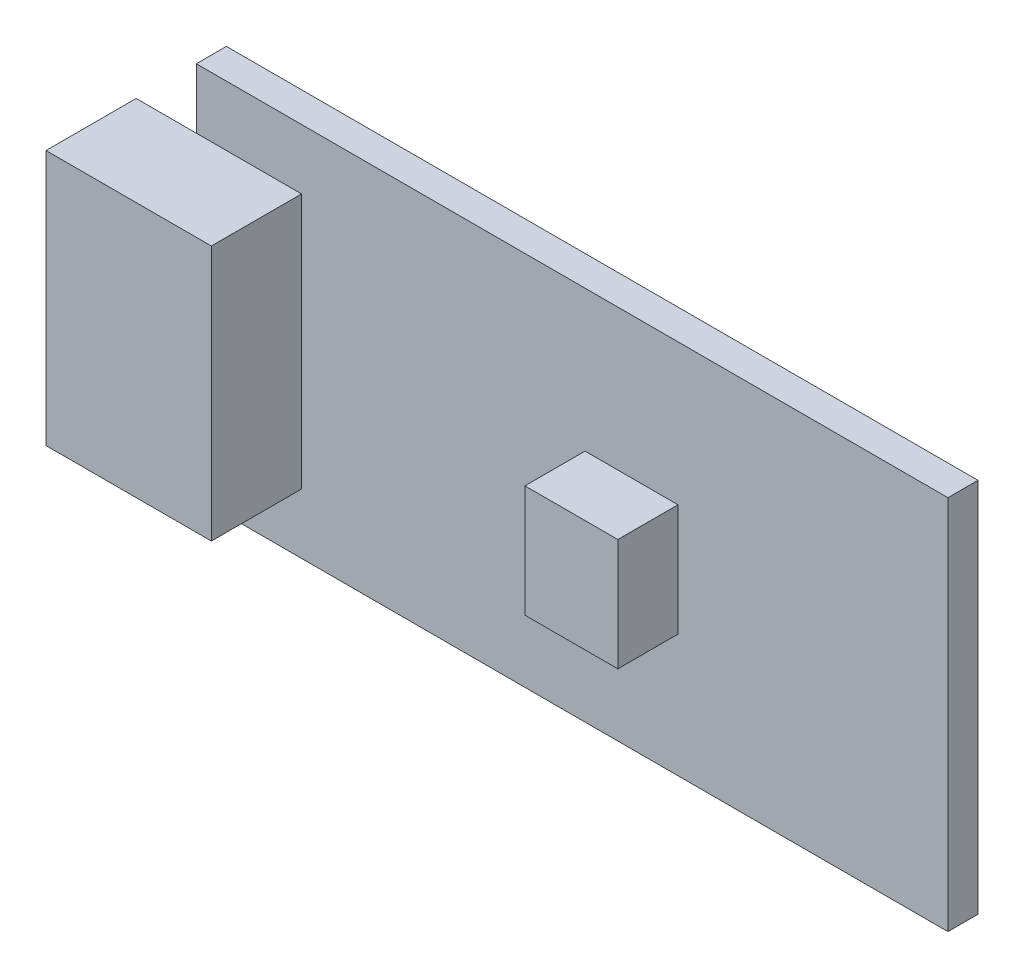
ISO-10303-21;
HEADER;
FILE_DESCRIPTION(('STEP AP214'),'2;1');
FILE_NAME('part.step','',(''),(''),'','','');
FILE_SCHEMA(('AUTOMOTIVE_DESIGN { 1 0 10303 214 1 1 1 1 }'));
ENDSEC;
DATA;
#1=APPLICATION_CONTEXT('core data for automotive mechanical design processes');
#2=APPLICATION_PROTOCOL_DEFINITION('international standard','automotive_design',2000,#1);
#3=PRODUCT_CONTEXT('',#1,'mechanical');
#4=PRODUCT('Part','Part','',(#3));
#5=PRODUCT_RELATED_PRODUCT_CATEGORY('part','',(#4));
#6=PRODUCT_DEFINITION_FORMATION('','',#4);
#7=PRODUCT_DEFINITION_CONTEXT('part definition',#1,'design');
#8=PRODUCT_DEFINITION('design','',#6,#7);
#9=PRODUCT_DEFINITION_SHAPE('','',#8);
#10=(LENGTH_UNIT() NAMED_UNIT(*) SI_UNIT(.MILLI.,.METRE.));
#11=(NAMED_UNIT(*) PLANE_ANGLE_UNIT() SI_UNIT($,.RADIAN.));
#12=(NAMED_UNIT(*) SI_UNIT($,.STERADIAN.) SOLID_ANGLE_UNIT());
#13=UNCERTAINTY_MEASURE_WITH_UNIT(LENGTH_MEASURE(1.E-05),#10,'distance_accuracy_value','');
#14=(GEOMETRIC_REPRESENTATION_CONTEXT(3) GLOBAL_UNCERTAINTY_ASSIGNED_CONTEXT((#13)) GLOBAL_UNIT_ASSIGNED_CONTEXT((#10,
#11,#12)) REPRESENTATION_CONTEXT('',''));
#15=CARTESIAN_POINT('',(0.,0.,0.));
#16=DIRECTION('',(0.,0.,1.));
#17=DIRECTION('',(1.,0.,0.));
#18=AXIS2_PLACEMENT_3D('',#15,#16,#17);
#19=CARTESIAN_POINT('',(0.,0.,1.));
#20=DIRECTION('',(0.,0.,-1.));
#21=DIRECTION('',(-1.,0.,0.));
#22=AXIS2_PLACEMENT_3D('',#19,#20,#21);
#23=PLANE('',#22);
#24=DIRECTION('',(0.,-1.,0.));
#25=VECTOR('',#24,1.);
#26=CARTESIAN_POINT('',(0.,0.,1.));
#27=LINE('',#26,#25);
#28=CARTESIAN_POINT('',(0.,12.5,1.));
#29=VERTEX_POINT('',#28);
#30=CARTESIAN_POINT('',(0.,10.5,1.));
#31=VERTEX_POINT('',#30);
#32=EDGE_CURVE('E235',#29,#31,#27,.T.);
#33=ORIENTED_EDGE('',*,*,#32,.T.);
#34=DIRECTION('',(1.,0.,0.));
#35=VECTOR('',#34,1.);
#36=CARTESIAN_POINT('',(-2.,10.5,1.));
#37=LINE('',#36,#35);
#38=CARTESIAN_POINT('',(3.5,10.5,1.));
#39=VERTEX_POINT('',#38);
#40=EDGE_CURVE('E60',#31,#39,#37,.T.);
#41=ORIENTED_EDGE('',*,*,#40,.T.);
#42=DIRECTION('',(0.,-1.,0.));
#43=VECTOR('',#42,1.);
#44=CARTESIAN_POINT('',(3.5,10.5,1.));
#45=LINE('',#44,#43);
#46=CARTESIAN_POINT('',(3.5,2.,1.));
#47=VERTEX_POINT('',#46);
#48=EDGE_CURVE('E55',#39,#47,#45,.T.);
#49=ORIENTED_EDGE('',*,*,#48,.T.);
#50=DIRECTION('',(1.,0.,0.));
#51=VECTOR('',#50,1.);
#52=CARTESIAN_POINT('',(-2.,2.,1.));
#53=LINE('',#52,#51);
#54=CARTESIAN_POINT('',(0.,2.,1.));
#55=VERTEX_POINT('',#54);
#56=EDGE_CURVE('E176',#55,#47,#53,.T.);
#57=ORIENTED_EDGE('',*,*,#56,.F.);
#58=CARTESIAN_POINT('',(0.,0.,1.));
#59=VERTEX_POINT('',#58);
#60=EDGE_CURVE('E240',#55,#59,#27,.T.);
#61=ORIENTED_EDGE('',*,*,#60,.T.);
#62=DIRECTION('',(1.,0.,0.));
#63=VECTOR('',#62,1.);
#64=CARTESIAN_POINT('',(0.,0.,1.));
#65=LINE('',#64,#63);
#66=CARTESIAN_POINT('',(25.,0.,1.));
#67=VERTEX_POINT('',#66);
#68=EDGE_CURVE('E238',#59,#67,#65,.T.);
#69=ORIENTED_EDGE('',*,*,#68,.T.);
#70=DIRECTION('',(0.,1.,0.));
#71=VECTOR('',#70,1.);
#72=CARTESIAN_POINT('',(25.,0.,1.));
#73=LINE('',#72,#71);
#74=CARTESIAN_POINT('',(25.,12.5,1.));
#75=VERTEX_POINT('',#74);
#76=EDGE_CURVE('E243',#67,#75,#73,.T.);
#77=ORIENTED_EDGE('',*,*,#76,.T.);
#78=DIRECTION('',(-1.,0.,0.));
#79=VECTOR('',#78,1.);
#80=CARTESIAN_POINT('',(0.,12.5,1.));
#81=LINE('',#80,#79);
#82=EDGE_CURVE('E246',#75,#29,#81,.T.);
#83=ORIENTED_EDGE('',*,*,#82,.T.);
#84=EDGE_LOOP('',(#33,#41,#49,#57,#61,#69,#77,#83));
#85=FACE_BOUND('',#84,.T.);
#86=DIRECTION('',(0.,-1.,0.));
#87=VECTOR('',#86,1.);
#88=CARTESIAN_POINT('',(12.9294574637413,7.80582880089753,1.));
#89=LINE('',#88,#87);
#90=CARTESIAN_POINT('',(12.9294574637413,7.80582880089753,1.));
#91=VERTEX_POINT('',#90);
#92=CARTESIAN_POINT('',(12.9294574637413,4.08005718279014,1.));
#93=VERTEX_POINT('',#92);
#94=EDGE_CURVE('E218',#91,#93,#89,.T.);
#95=ORIENTED_EDGE('',*,*,#94,.F.);
#96=DIRECTION('',(-1.,0.,0.));
#97=VECTOR('',#96,1.);
#98=CARTESIAN_POINT('',(12.9294574637413,7.80582880089753,1.));
#99=LINE('',#98,#97);
#100=CARTESIAN_POINT('',(16.0210644823735,7.80582880089753,1.));
#101=VERTEX_POINT('',#100);
#102=EDGE_CURVE('E230',#101,#91,#99,.T.);
#103=ORIENTED_EDGE('',*,*,#102,.F.);
#104=DIRECTION('',(0.,1.,0.));
#105=VECTOR('',#104,1.);
#106=CARTESIAN_POINT('',(16.0210644823735,7.80582880089753,1.));
#107=LINE('',#106,#105);
#108=CARTESIAN_POINT('',(16.0210644823735,4.08005718279014,1.));
#109=VERTEX_POINT('',#108);
#110=EDGE_CURVE('E226',#109,#101,#107,.T.);
#111=ORIENTED_EDGE('',*,*,#110,.F.);
#112=DIRECTION('',(1.,0.,0.));
#113=VECTOR('',#112,1.);
#114=CARTESIAN_POINT('',(12.9294574637413,4.08005718279014,1.));
#115=LINE('',#114,#113);
#116=EDGE_CURVE('E222',#93,#109,#115,.T.);
#117=ORIENTED_EDGE('',*,*,#116,.F.);
#118=EDGE_LOOP('',(#95,#103,#111,#117));
#119=FACE_BOUND('',#118,.T.);
#120=ADVANCED_FACE('F39',(#85,#119),#23,.F.);
#121=CARTESIAN_POINT('',(0.,0.,0.));
#122=DIRECTION('',(0.,0.,-1.));
#123=DIRECTION('',(-1.,0.,0.));
#124=AXIS2_PLACEMENT_3D('',#121,#122,#123);
#125=PLANE('',#124);
#126=DIRECTION('',(0.,-1.,0.));
#127=VECTOR('',#126,1.);
#128=CARTESIAN_POINT('',(0.,0.,0.));
#129=LINE('',#128,#127);
#130=CARTESIAN_POINT('',(0.,12.5,0.));
#131=VERTEX_POINT('',#130);
#132=CARTESIAN_POINT('',(0.,0.,0.));
#133=VERTEX_POINT('',#132);
#134=EDGE_CURVE('E234',#131,#133,#129,.T.);
#135=ORIENTED_EDGE('',*,*,#134,.F.);
#136=DIRECTION('',(-1.,0.,0.));
#137=VECTOR('',#136,1.);
#138=CARTESIAN_POINT('',(0.,12.5,0.));
#139=LINE('',#138,#137);
#140=CARTESIAN_POINT('',(25.,12.5,0.));
#141=VERTEX_POINT('',#140);
#142=EDGE_CURVE('E259',#141,#131,#139,.T.);
#143=ORIENTED_EDGE('',*,*,#142,.F.);
#144=DIRECTION('',(0.,1.,0.));
#145=VECTOR('',#144,1.);
#146=CARTESIAN_POINT('',(25.,0.,0.));
#147=LINE('',#146,#145);
#148=CARTESIAN_POINT('',(25.,0.,0.));
#149=VERTEX_POINT('',#148);
#150=EDGE_CURVE('E256',#149,#141,#147,.T.);
#151=ORIENTED_EDGE('',*,*,#150,.F.);
#152=DIRECTION('',(1.,0.,0.));
#153=VECTOR('',#152,1.);
#154=CARTESIAN_POINT('',(0.,0.,0.));
#155=LINE('',#154,#153);
#156=EDGE_CURVE('E253',#133,#149,#155,.T.);
#157=ORIENTED_EDGE('',*,*,#156,.F.);
#158=EDGE_LOOP('',(#135,#143,#151,#157));
#159=FACE_BOUND('',#158,.T.);
#160=ADVANCED_FACE('F281',(#159),#125,.T.);
#161=CARTESIAN_POINT('',(0.,0.,1.));
#162=DIRECTION('',(1.,0.,0.));
#163=DIRECTION('',(0.,0.,-1.));
#164=AXIS2_PLACEMENT_3D('',#161,#162,#163);
#165=PLANE('',#164);
#166=ORIENTED_EDGE('',*,*,#134,.T.);
#167=DIRECTION('',(0.,0.,-1.));
#168=VECTOR('',#167,1.);
#169=CARTESIAN_POINT('',(0.,0.,1.));
#170=LINE('',#169,#168);
#171=EDGE_CURVE('E11',#59,#133,#170,.T.);
#172=ORIENTED_EDGE('',*,*,#171,.F.);
#173=ORIENTED_EDGE('',*,*,#60,.F.);
#174=EDGE_CURVE('E239',#31,#55,#27,.T.);
#175=ORIENTED_EDGE('',*,*,#174,.F.);
#176=ORIENTED_EDGE('',*,*,#32,.F.);
#177=DIRECTION('',(0.,0.,-1.));
#178=VECTOR('',#177,1.);
#179=CARTESIAN_POINT('',(0.,12.5,1.));
#180=LINE('',#179,#178);
#181=EDGE_CURVE('E249',#29,#131,#180,.T.);
#182=ORIENTED_EDGE('',*,*,#181,.T.);
#183=EDGE_LOOP('',(#166,#172,#173,#175,#176,#182));
#184=FACE_BOUND('',#183,.T.);
#185=ADVANCED_FACE('F41',(#184),#165,.F.);
#186=CARTESIAN_POINT('',(0.,0.,1.));
#187=DIRECTION('',(0.,1.,0.));
#188=DIRECTION('',(0.,0.,1.));
#189=AXIS2_PLACEMENT_3D('',#186,#187,#188);
#190=PLANE('',#189);
#191=ORIENTED_EDGE('',*,*,#156,.T.);
#192=DIRECTION('',(0.,0.,-1.));
#193=VECTOR('',#192,1.);
#194=CARTESIAN_POINT('',(25.,0.,1.));
#195=LINE('',#194,#193);
#196=EDGE_CURVE('E48',#67,#149,#195,.T.);
#197=ORIENTED_EDGE('',*,*,#196,.F.);
#198=ORIENTED_EDGE('',*,*,#68,.F.);
#199=ORIENTED_EDGE('',*,*,#171,.T.);
#200=EDGE_LOOP('',(#191,#197,#198,#199));
#201=FACE_BOUND('',#200,.T.);
#202=ADVANCED_FACE('F303',(#201),#190,.F.);
#203=CARTESIAN_POINT('',(25.,0.,1.));
#204=DIRECTION('',(-1.,0.,0.));
#205=DIRECTION('',(0.,0.,1.));
#206=AXIS2_PLACEMENT_3D('',#203,#204,#205);
#207=PLANE('',#206);
#208=ORIENTED_EDGE('',*,*,#150,.T.);
#209=DIRECTION('',(0.,0.,-1.));
#210=VECTOR('',#209,1.);
#211=CARTESIAN_POINT('',(25.,12.5,1.));
#212=LINE('',#211,#210);
#213=EDGE_CURVE('E265',#75,#141,#212,.T.);
#214=ORIENTED_EDGE('',*,*,#213,.F.);
#215=ORIENTED_EDGE('',*,*,#76,.F.);
#216=ORIENTED_EDGE('',*,*,#196,.T.);
#217=EDGE_LOOP('',(#208,#214,#215,#216));
#218=FACE_BOUND('',#217,.T.);
#219=ADVANCED_FACE('F274',(#218),#207,.F.);
#220=CARTESIAN_POINT('',(0.,12.5,1.));
#221=DIRECTION('',(0.,-1.,0.));
#222=DIRECTION('',(0.,0.,-1.));
#223=AXIS2_PLACEMENT_3D('',#220,#221,#222);
#224=PLANE('',#223);
#225=ORIENTED_EDGE('',*,*,#142,.T.);
#226=ORIENTED_EDGE('',*,*,#181,.F.);
#227=ORIENTED_EDGE('',*,*,#82,.F.);
#228=ORIENTED_EDGE('',*,*,#213,.T.);
#229=EDGE_LOOP('',(#225,#226,#227,#228));
#230=FACE_BOUND('',#229,.T.);
#231=ADVANCED_FACE('F284',(#230),#224,.F.);
#232=CARTESIAN_POINT('',(0.,7.80582880089753,3.));
#233=DIRECTION('',(0.,1.,0.));
#234=DIRECTION('',(0.,0.,1.));
#235=AXIS2_PLACEMENT_3D('',#232,#233,#234);
#236=PLANE('',#235);
#237=ORIENTED_EDGE('',*,*,#102,.T.);
#238=DIRECTION('',(0.,0.,-1.));
#239=VECTOR('',#238,1.);
#240=CARTESIAN_POINT('',(12.9294574637413,7.80582880089753,3.));
#241=LINE('',#240,#239);
#242=CARTESIAN_POINT('',(12.9294574637413,7.80582880089753,3.));
#243=VERTEX_POINT('',#242);
#244=EDGE_CURVE('E210',#243,#91,#241,.T.);
#245=ORIENTED_EDGE('',*,*,#244,.F.);
#246=DIRECTION('',(1.,0.,0.));
#247=VECTOR('',#246,1.);
#248=CARTESIAN_POINT('',(0.,7.80582880089753,3.));
#249=LINE('',#248,#247);
#250=CARTESIAN_POINT('',(16.0210644823735,7.80582880089753,3.));
#251=VERTEX_POINT('',#250);
#252=EDGE_CURVE('E192',#243,#251,#249,.T.);
#253=ORIENTED_EDGE('',*,*,#252,.T.);
#254=DIRECTION('',(0.,0.,-1.));
#255=VECTOR('',#254,1.);
#256=CARTESIAN_POINT('',(16.0210644823735,7.80582880089753,3.));
#257=LINE('',#256,#255);
#258=EDGE_CURVE('E214',#251,#101,#257,.T.);
#259=ORIENTED_EDGE('',*,*,#258,.T.);
#260=EDGE_LOOP('',(#237,#245,#253,#259));
#261=FACE_BOUND('',#260,.T.);
#262=ADVANCED_FACE('F321',(#261),#236,.T.);
#263=CARTESIAN_POINT('',(0.,4.08005718279014,3.));
#264=DIRECTION('',(0.,1.,0.));
#265=DIRECTION('',(0.,0.,1.));
#266=AXIS2_PLACEMENT_3D('',#263,#264,#265);
#267=PLANE('',#266);
#268=DIRECTION('',(0.,0.,-1.));
#269=VECTOR('',#268,1.);
#270=CARTESIAN_POINT('',(12.9294574637413,4.08005718279014,3.));
#271=LINE('',#270,#269);
#272=CARTESIAN_POINT('',(12.9294574637413,4.08005718279014,3.));
#273=VERTEX_POINT('',#272);
#274=EDGE_CURVE('E206',#273,#93,#271,.T.);
#275=ORIENTED_EDGE('',*,*,#274,.T.);
#276=ORIENTED_EDGE('',*,*,#116,.T.);
#277=DIRECTION('',(0.,0.,-1.));
#278=VECTOR('',#277,1.);
#279=CARTESIAN_POINT('',(16.0210644823735,4.08005718279014,3.));
#280=LINE('',#279,#278);
#281=CARTESIAN_POINT('',(16.0210644823735,4.08005718279014,3.));
#282=VERTEX_POINT('',#281);
#283=EDGE_CURVE('E202',#282,#109,#280,.T.);
#284=ORIENTED_EDGE('',*,*,#283,.F.);
#285=DIRECTION('',(1.,0.,0.));
#286=VECTOR('',#285,1.);
#287=CARTESIAN_POINT('',(0.,4.08005718279014,3.));
#288=LINE('',#287,#286);
#289=EDGE_CURVE('E199',#273,#282,#288,.T.);
#290=ORIENTED_EDGE('',*,*,#289,.F.);
#291=EDGE_LOOP('',(#275,#276,#284,#290));
#292=FACE_BOUND('',#291,.T.);
#293=ADVANCED_FACE('F325',(#292),#267,.F.);
#294=CARTESIAN_POINT('',(16.0210644823735,0.,3.));
#295=DIRECTION('',(1.,0.,0.));
#296=DIRECTION('',(0.,0.,-1.));
#297=AXIS2_PLACEMENT_3D('',#294,#295,#296);
#298=PLANE('',#297);
#299=ORIENTED_EDGE('',*,*,#110,.T.);
#300=ORIENTED_EDGE('',*,*,#258,.F.);
#301=DIRECTION('',(0.,-1.,0.));
#302=VECTOR('',#301,1.);
#303=CARTESIAN_POINT('',(16.0210644823735,0.,3.));
#304=LINE('',#303,#302);
#305=EDGE_CURVE('E182',#251,#282,#304,.T.);
#306=ORIENTED_EDGE('',*,*,#305,.T.);
#307=ORIENTED_EDGE('',*,*,#283,.T.);
#308=EDGE_LOOP('',(#299,#300,#306,#307));
#309=FACE_BOUND('',#308,.T.);
#310=ADVANCED_FACE('F317',(#309),#298,.T.);
#311=CARTESIAN_POINT('',(12.9294574637413,0.,3.));
#312=DIRECTION('',(1.,0.,0.));
#313=DIRECTION('',(0.,0.,-1.));
#314=AXIS2_PLACEMENT_3D('',#311,#312,#313);
#315=PLANE('',#314);
#316=ORIENTED_EDGE('',*,*,#244,.T.);
#317=ORIENTED_EDGE('',*,*,#94,.T.);
#318=ORIENTED_EDGE('',*,*,#274,.F.);
#319=DIRECTION('',(0.,-1.,0.));
#320=VECTOR('',#319,1.);
#321=CARTESIAN_POINT('',(12.9294574637413,0.,3.));
#322=LINE('',#321,#320);
#323=EDGE_CURVE('E196',#243,#273,#322,.T.);
#324=ORIENTED_EDGE('',*,*,#323,.F.);
#325=EDGE_LOOP('',(#316,#317,#318,#324));
#326=FACE_BOUND('',#325,.T.);
#327=ADVANCED_FACE('F333',(#326),#315,.F.);
#328=CARTESIAN_POINT('',(0.,0.,3.));
#329=DIRECTION('',(0.,0.,1.));
#330=DIRECTION('',(1.,0.,0.));
#331=AXIS2_PLACEMENT_3D('',#328,#329,#330);
#332=PLANE('',#331);
#333=ORIENTED_EDGE('',*,*,#305,.F.);
#334=ORIENTED_EDGE('',*,*,#252,.F.);
#335=ORIENTED_EDGE('',*,*,#323,.T.);
#336=ORIENTED_EDGE('',*,*,#289,.T.);
#337=EDGE_LOOP('',(#333,#334,#335,#336));
#338=FACE_BOUND('',#337,.T.);
#339=ADVANCED_FACE('F335',(#338),#332,.T.);
#340=CARTESIAN_POINT('',(0.,0.,1.));
#341=DIRECTION('',(0.,0.,-1.));
#342=DIRECTION('',(-1.,0.,0.));
#343=AXIS2_PLACEMENT_3D('',#340,#341,#342);
#344=PLANE('',#343);
#345=ORIENTED_EDGE('',*,*,#174,.T.);
#346=CARTESIAN_POINT('',(-2.,2.,1.));
#347=VERTEX_POINT('',#346);
#348=EDGE_CURVE('E163',#347,#55,#53,.T.);
#349=ORIENTED_EDGE('',*,*,#348,.F.);
#350=DIRECTION('',(0.,-1.,0.));
#351=VECTOR('',#350,1.);
#352=CARTESIAN_POINT('',(-2.,10.5,1.));
#353=LINE('',#352,#351);
#354=CARTESIAN_POINT('',(-2.,10.5,1.));
#355=VERTEX_POINT('',#354);
#356=EDGE_CURVE('E160',#355,#347,#353,.T.);
#357=ORIENTED_EDGE('',*,*,#356,.F.);
#358=EDGE_CURVE('E170',#355,#31,#37,.T.);
#359=ORIENTED_EDGE('',*,*,#358,.T.);
#360=EDGE_LOOP('',(#345,#349,#357,#359));
#361=FACE_BOUND('',#360,.T.);
#362=ADVANCED_FACE('F294',(#361),#344,.T.);
#363=CARTESIAN_POINT('',(-2.,10.5,4.));
#364=DIRECTION('',(0.,1.,0.));
#365=DIRECTION('',(0.,0.,1.));
#366=AXIS2_PLACEMENT_3D('',#363,#364,#365);
#367=PLANE('',#366);
#368=ORIENTED_EDGE('',*,*,#358,.F.);
#369=DIRECTION('',(0.,0.,-1.));
#370=VECTOR('',#369,1.);
#371=CARTESIAN_POINT('',(-2.,10.5,4.));
#372=LINE('',#371,#370);
#373=CARTESIAN_POINT('',(-2.,10.5,4.));
#374=VERTEX_POINT('',#373);
#375=EDGE_CURVE('E157',#374,#355,#372,.T.);
#376=ORIENTED_EDGE('',*,*,#375,.F.);
#377=DIRECTION('',(1.,0.,0.));
#378=VECTOR('',#377,1.);
#379=CARTESIAN_POINT('',(-2.,10.5,4.));
#380=LINE('',#379,#378);
#381=CARTESIAN_POINT('',(3.5,10.5,4.));
#382=VERTEX_POINT('',#381);
#383=EDGE_CURVE('E149',#374,#382,#380,.T.);
#384=ORIENTED_EDGE('',*,*,#383,.T.);
#385=DIRECTION('',(0.,0.,-1.));
#386=VECTOR('',#385,1.);
#387=CARTESIAN_POINT('',(3.5,10.5,4.));
#388=LINE('',#387,#386);
#389=EDGE_CURVE('E135',#382,#39,#388,.T.);
#390=ORIENTED_EDGE('',*,*,#389,.T.);
#391=ORIENTED_EDGE('',*,*,#40,.F.);
#392=EDGE_LOOP('',(#368,#376,#384,#390,#391));
#393=FACE_BOUND('',#392,.T.);
#394=ADVANCED_FACE('F156',(#393),#367,.T.);
#395=CARTESIAN_POINT('',(-2.,10.5,4.));
#396=DIRECTION('',(1.,0.,0.));
#397=DIRECTION('',(0.,0.,-1.));
#398=AXIS2_PLACEMENT_3D('',#395,#396,#397);
#399=PLANE('',#398);
#400=ORIENTED_EDGE('',*,*,#356,.T.);
#401=DIRECTION('',(0.,0.,-1.));
#402=VECTOR('',#401,1.);
#403=CARTESIAN_POINT('',(-2.,2.,4.));
#404=LINE('',#403,#402);
#405=CARTESIAN_POINT('',(-2.,2.,4.));
#406=VERTEX_POINT('',#405);
#407=EDGE_CURVE('E183',#406,#347,#404,.T.);
#408=ORIENTED_EDGE('',*,*,#407,.F.);
#409=DIRECTION('',(0.,-1.,0.));
#410=VECTOR('',#409,1.);
#411=CARTESIAN_POINT('',(-2.,10.5,4.));
#412=LINE('',#411,#410);
#413=EDGE_CURVE('E144',#374,#406,#412,.T.);
#414=ORIENTED_EDGE('',*,*,#413,.F.);
#415=ORIENTED_EDGE('',*,*,#375,.T.);
#416=EDGE_LOOP('',(#400,#408,#414,#415));
#417=FACE_BOUND('',#416,.T.);
#418=ADVANCED_FACE('F298',(#417),#399,.F.);
#419=CARTESIAN_POINT('',(-2.,2.,4.));
#420=DIRECTION('',(0.,1.,0.));
#421=DIRECTION('',(0.,0.,1.));
#422=AXIS2_PLACEMENT_3D('',#419,#420,#421);
#423=PLANE('',#422);
#424=ORIENTED_EDGE('',*,*,#348,.T.);
#425=ORIENTED_EDGE('',*,*,#56,.T.);
#426=DIRECTION('',(0.,0.,-1.));
#427=VECTOR('',#426,1.);
#428=CARTESIAN_POINT('',(3.5,2.,4.));
#429=LINE('',#428,#427);
#430=CARTESIAN_POINT('',(3.5,2.,4.));
#431=VERTEX_POINT('',#430);
#432=EDGE_CURVE('E143',#431,#47,#429,.T.);
#433=ORIENTED_EDGE('',*,*,#432,.F.);
#434=DIRECTION('',(1.,0.,0.));
#435=VECTOR('',#434,1.);
#436=CARTESIAN_POINT('',(-2.,2.,4.));
#437=LINE('',#436,#435);
#438=EDGE_CURVE('E151',#406,#431,#437,.T.);
#439=ORIENTED_EDGE('',*,*,#438,.F.);
#440=ORIENTED_EDGE('',*,*,#407,.T.);
#441=EDGE_LOOP('',(#424,#425,#433,#439,#440));
#442=FACE_BOUND('',#441,.T.);
#443=ADVANCED_FACE('F300',(#442),#423,.F.);
#444=CARTESIAN_POINT('',(3.5,10.5,4.));
#445=DIRECTION('',(1.,0.,0.));
#446=DIRECTION('',(0.,0.,-1.));
#447=AXIS2_PLACEMENT_3D('',#444,#445,#446);
#448=PLANE('',#447);
#449=ORIENTED_EDGE('',*,*,#48,.F.);
#450=ORIENTED_EDGE('',*,*,#389,.F.);
#451=DIRECTION('',(0.,-1.,0.));
#452=VECTOR('',#451,1.);
#453=CARTESIAN_POINT('',(3.5,10.5,4.));
#454=LINE('',#453,#452);
#455=EDGE_CURVE('E139',#382,#431,#454,.T.);
#456=ORIENTED_EDGE('',*,*,#455,.T.);
#457=ORIENTED_EDGE('',*,*,#432,.T.);
#458=EDGE_LOOP('',(#449,#450,#456,#457));
#459=FACE_BOUND('',#458,.T.);
#460=ADVANCED_FACE('F137',(#459),#448,.T.);
#461=CARTESIAN_POINT('',(0.,0.,4.));
#462=DIRECTION('',(0.,0.,-1.));
#463=DIRECTION('',(-1.,0.,0.));
#464=AXIS2_PLACEMENT_3D('',#461,#462,#463);
#465=PLANE('',#464);
#466=ORIENTED_EDGE('',*,*,#383,.F.);
#467=ORIENTED_EDGE('',*,*,#413,.T.);
#468=ORIENTED_EDGE('',*,*,#438,.T.);
#469=ORIENTED_EDGE('',*,*,#455,.F.);
#470=EDGE_LOOP('',(#466,#467,#468,#469));
#471=FACE_BOUND('',#470,.T.);
#472=ADVANCED_FACE('F148',(#471),#465,.F.);
#473=CLOSED_SHELL('',(#120,#160,#185,#202,#219,#231,#262,#293,#310,#327,#339,#362,#394,#418,
#443,#460,#472));
#474=MANIFOLD_SOLID_BREP('B2',#473);
#475=ADVANCED_BREP_SHAPE_REPRESENTATION('',(#18,#474),#14);
#476=SHAPE_DEFINITION_REPRESENTATION(#9,#475);
ENDSEC;
END-ISO-10303-21;
